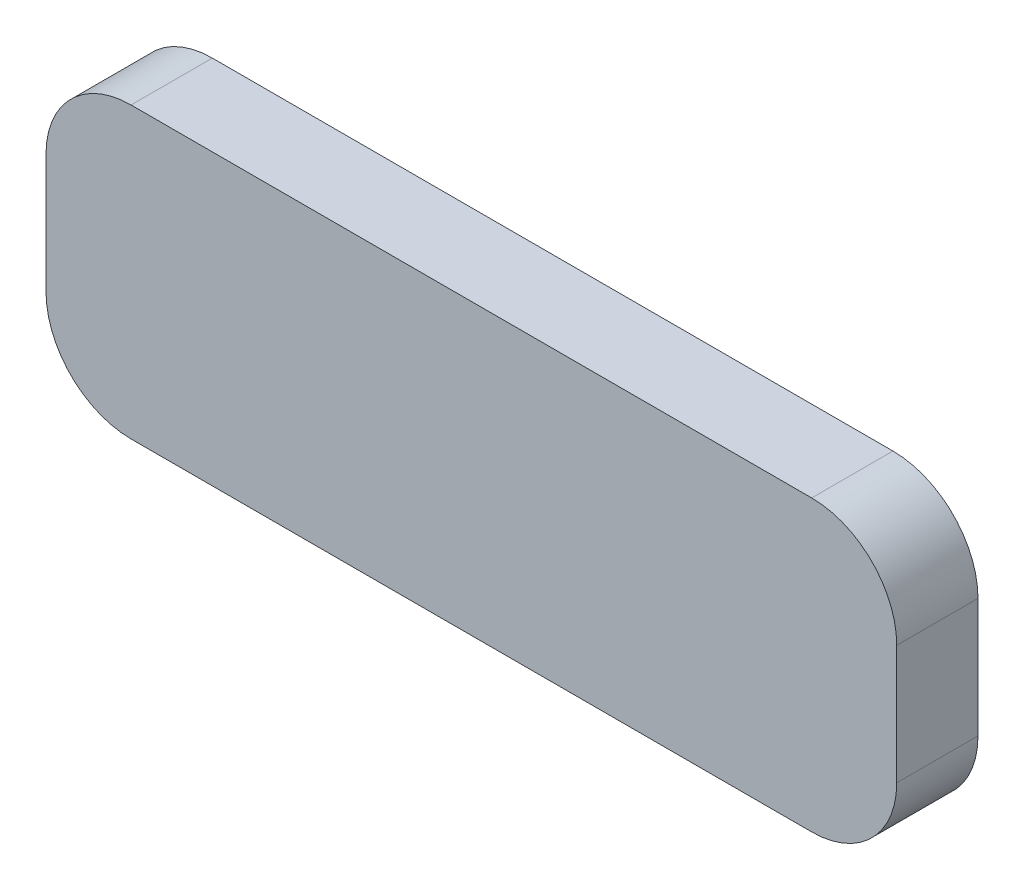
ISO-10303-21;
HEADER;
FILE_DESCRIPTION(('STEP AP214'),'2;1');
FILE_NAME('part.step','',(''),(''),'','','');
FILE_SCHEMA(('AUTOMOTIVE_DESIGN { 1 0 10303 214 1 1 1 1 }'));
ENDSEC;
DATA;
#1=APPLICATION_CONTEXT('core data for automotive mechanical design processes');
#2=APPLICATION_PROTOCOL_DEFINITION('international standard','automotive_design',2000,#1);
#3=PRODUCT_CONTEXT('',#1,'mechanical');
#4=PRODUCT('Part','Part','',(#3));
#5=PRODUCT_RELATED_PRODUCT_CATEGORY('part','',(#4));
#6=PRODUCT_DEFINITION_FORMATION('','',#4);
#7=PRODUCT_DEFINITION_CONTEXT('part definition',#1,'design');
#8=PRODUCT_DEFINITION('design','',#6,#7);
#9=PRODUCT_DEFINITION_SHAPE('','',#8);
#10=(LENGTH_UNIT() NAMED_UNIT(*) SI_UNIT(.MILLI.,.METRE.));
#11=(NAMED_UNIT(*) PLANE_ANGLE_UNIT() SI_UNIT($,.RADIAN.));
#12=(NAMED_UNIT(*) SI_UNIT($,.STERADIAN.) SOLID_ANGLE_UNIT());
#13=UNCERTAINTY_MEASURE_WITH_UNIT(LENGTH_MEASURE(1.E-05),#10,'distance_accuracy_value','');
#14=(GEOMETRIC_REPRESENTATION_CONTEXT(3) GLOBAL_UNCERTAINTY_ASSIGNED_CONTEXT((#13)) GLOBAL_UNIT_ASSIGNED_CONTEXT((#10,
#11,#12)) REPRESENTATION_CONTEXT('',''));
#15=CARTESIAN_POINT('',(0.,0.,0.));
#16=DIRECTION('',(0.,0.,1.));
#17=DIRECTION('',(1.,0.,0.));
#18=AXIS2_PLACEMENT_3D('',#15,#16,#17);
#19=CARTESIAN_POINT('',(5.,0.224799999999999,4.7752));
#20=DIRECTION('',(0.,0.,-1.));
#21=DIRECTION('',(-1.,0.,0.));
#22=AXIS2_PLACEMENT_3D('',#19,#20,#21);
#23=CYLINDRICAL_SURFACE('',#22,5.);
#24=CARTESIAN_POINT('',(5.,0.224799999999999,0.));
#25=DIRECTION('',(0.,0.,1.));
#26=DIRECTION('',(1.,0.,0.));
#27=AXIS2_PLACEMENT_3D('',#24,#25,#26);
#28=CIRCLE('',#27,5.);
#29=CARTESIAN_POINT('',(0.,0.224800000000035,0.));
#30=VERTEX_POINT('',#29);
#31=CARTESIAN_POINT('',(5.00000000000004,-4.7752,0.));
#32=VERTEX_POINT('',#31);
#33=EDGE_CURVE('E148',#30,#32,#28,.T.);
#34=ORIENTED_EDGE('',*,*,#33,.T.);
#35=DIRECTION('',(0.,0.,-1.));
#36=VECTOR('',#35,1.);
#37=CARTESIAN_POINT('',(5.00000000000004,-4.7752,4.7752));
#38=LINE('',#37,#36);
#39=CARTESIAN_POINT('',(5.00000000000004,-4.7752,4.7752));
#40=VERTEX_POINT('',#39);
#41=EDGE_CURVE('E11',#40,#32,#38,.T.);
#42=ORIENTED_EDGE('',*,*,#41,.F.);
#43=CARTESIAN_POINT('',(5.,0.224799999999999,4.7752));
#44=DIRECTION('',(0.,0.,1.));
#45=DIRECTION('',(1.,0.,0.));
#46=AXIS2_PLACEMENT_3D('',#43,#44,#45);
#47=CIRCLE('',#46,5.);
#48=CARTESIAN_POINT('',(0.,0.224800000000035,4.7752));
#49=VERTEX_POINT('',#48);
#50=EDGE_CURVE('E170',#49,#40,#47,.T.);
#51=ORIENTED_EDGE('',*,*,#50,.F.);
#52=DIRECTION('',(0.,0.,-1.));
#53=VECTOR('',#52,1.);
#54=CARTESIAN_POINT('',(0.,0.224800000000035,4.7752));
#55=LINE('',#54,#53);
#56=EDGE_CURVE('E144',#49,#30,#55,.T.);
#57=ORIENTED_EDGE('',*,*,#56,.T.);
#58=EDGE_LOOP('',(#34,#42,#51,#57));
#59=FACE_BOUND('',#58,.T.);
#60=ADVANCED_FACE('F47',(#59),#23,.T.);
#61=CARTESIAN_POINT('',(5.00000000000004,-4.7752,4.7752));
#62=DIRECTION('',(0.,1.,0.));
#63=DIRECTION('',(0.,0.,1.));
#64=AXIS2_PLACEMENT_3D('',#61,#62,#63);
#65=PLANE('',#64);
#66=DIRECTION('',(1.,0.,0.));
#67=VECTOR('',#66,1.);
#68=CARTESIAN_POINT('',(5.00000000000004,-4.7752,0.));
#69=LINE('',#68,#67);
#70=CARTESIAN_POINT('',(45.,-4.7752,0.));
#71=VERTEX_POINT('',#70);
#72=EDGE_CURVE('E152',#32,#71,#69,.T.);
#73=ORIENTED_EDGE('',*,*,#72,.T.);
#74=DIRECTION('',(0.,0.,-1.));
#75=VECTOR('',#74,1.);
#76=CARTESIAN_POINT('',(45.,-4.7752,4.7752));
#77=LINE('',#76,#75);
#78=CARTESIAN_POINT('',(45.,-4.7752,4.7752));
#79=VERTEX_POINT('',#78);
#80=EDGE_CURVE('E56',#79,#71,#77,.T.);
#81=ORIENTED_EDGE('',*,*,#80,.F.);
#82=DIRECTION('',(1.,0.,0.));
#83=VECTOR('',#82,1.);
#84=CARTESIAN_POINT('',(5.00000000000004,-4.7752,4.7752));
#85=LINE('',#84,#83);
#86=EDGE_CURVE('E107',#40,#79,#85,.T.);
#87=ORIENTED_EDGE('',*,*,#86,.F.);
#88=ORIENTED_EDGE('',*,*,#41,.T.);
#89=EDGE_LOOP('',(#73,#81,#87,#88));
#90=FACE_BOUND('',#89,.T.);
#91=ADVANCED_FACE('F216',(#90),#65,.F.);
#92=CARTESIAN_POINT('',(45.,0.224799999999999,4.7752));
#93=DIRECTION('',(0.,0.,-1.));
#94=DIRECTION('',(-1.,0.,0.));
#95=AXIS2_PLACEMENT_3D('',#92,#93,#94);
#96=CYLINDRICAL_SURFACE('',#95,5.);
#97=CARTESIAN_POINT('',(45.,0.224799999999999,0.));
#98=DIRECTION('',(0.,0.,1.));
#99=DIRECTION('',(1.,0.,0.));
#100=AXIS2_PLACEMENT_3D('',#97,#98,#99);
#101=CIRCLE('',#100,5.);
#102=CARTESIAN_POINT('',(50.,0.224800000000035,0.));
#103=VERTEX_POINT('',#102);
#104=EDGE_CURVE('E155',#71,#103,#101,.T.);
#105=ORIENTED_EDGE('',*,*,#104,.T.);
#106=DIRECTION('',(0.,0.,-1.));
#107=VECTOR('',#106,1.);
#108=CARTESIAN_POINT('',(50.,0.224800000000035,4.7752));
#109=LINE('',#108,#107);
#110=CARTESIAN_POINT('',(50.,0.224800000000035,4.7752));
#111=VERTEX_POINT('',#110);
#112=EDGE_CURVE('E181',#111,#103,#109,.T.);
#113=ORIENTED_EDGE('',*,*,#112,.F.);
#114=CARTESIAN_POINT('',(45.,0.224799999999999,4.7752));
#115=DIRECTION('',(0.,0.,1.));
#116=DIRECTION('',(1.,0.,0.));
#117=AXIS2_PLACEMENT_3D('',#114,#115,#116);
#118=CIRCLE('',#117,5.);
#119=EDGE_CURVE('E191',#79,#111,#118,.T.);
#120=ORIENTED_EDGE('',*,*,#119,.F.);
#121=ORIENTED_EDGE('',*,*,#80,.T.);
#122=EDGE_LOOP('',(#105,#113,#120,#121));
#123=FACE_BOUND('',#122,.T.);
#124=ADVANCED_FACE('F189',(#123),#96,.T.);
#125=CARTESIAN_POINT('',(50.,7.2248,4.7752));
#126=DIRECTION('',(-1.,0.,0.));
#127=DIRECTION('',(0.,0.,1.));
#128=AXIS2_PLACEMENT_3D('',#125,#126,#127);
#129=PLANE('',#128);
#130=DIRECTION('',(0.,1.,0.));
#131=VECTOR('',#130,1.);
#132=CARTESIAN_POINT('',(50.,7.2248,0.));
#133=LINE('',#132,#131);
#134=CARTESIAN_POINT('',(50.,7.2248,0.));
#135=VERTEX_POINT('',#134);
#136=EDGE_CURVE('E158',#103,#135,#133,.T.);
#137=ORIENTED_EDGE('',*,*,#136,.T.);
#138=DIRECTION('',(0.,0.,-1.));
#139=VECTOR('',#138,1.);
#140=CARTESIAN_POINT('',(50.,7.2248,4.7752));
#141=LINE('',#140,#139);
#142=CARTESIAN_POINT('',(50.,7.2248,4.7752));
#143=VERTEX_POINT('',#142);
#144=EDGE_CURVE('E177',#143,#135,#141,.T.);
#145=ORIENTED_EDGE('',*,*,#144,.F.);
#146=DIRECTION('',(0.,1.,0.));
#147=VECTOR('',#146,1.);
#148=CARTESIAN_POINT('',(50.,7.2248,4.7752));
#149=LINE('',#148,#147);
#150=EDGE_CURVE('E204',#111,#143,#149,.T.);
#151=ORIENTED_EDGE('',*,*,#150,.F.);
#152=ORIENTED_EDGE('',*,*,#112,.T.);
#153=EDGE_LOOP('',(#137,#145,#151,#152));
#154=FACE_BOUND('',#153,.T.);
#155=ADVANCED_FACE('F199',(#154),#129,.F.);
#156=CARTESIAN_POINT('',(45.,7.2248,4.7752));
#157=DIRECTION('',(0.,0.,-1.));
#158=DIRECTION('',(-1.,0.,0.));
#159=AXIS2_PLACEMENT_3D('',#156,#157,#158);
#160=CYLINDRICAL_SURFACE('',#159,5.);
#161=CARTESIAN_POINT('',(45.,7.2248,0.));
#162=DIRECTION('',(0.,0.,1.));
#163=DIRECTION('',(-1.,0.,0.));
#164=AXIS2_PLACEMENT_3D('',#161,#162,#163);
#165=CIRCLE('',#164,5.);
#166=CARTESIAN_POINT('',(45.,12.2248,0.));
#167=VERTEX_POINT('',#166);
#168=EDGE_CURVE('E161',#135,#167,#165,.T.);
#169=ORIENTED_EDGE('',*,*,#168,.T.);
#170=DIRECTION('',(0.,0.,-1.));
#171=VECTOR('',#170,1.);
#172=CARTESIAN_POINT('',(45.,12.2248,4.7752));
#173=LINE('',#172,#171);
#174=CARTESIAN_POINT('',(45.,12.2248,4.7752));
#175=VERTEX_POINT('',#174);
#176=EDGE_CURVE('E137',#175,#167,#173,.T.);
#177=ORIENTED_EDGE('',*,*,#176,.F.);
#178=CARTESIAN_POINT('',(45.,7.2248,4.7752));
#179=DIRECTION('',(0.,0.,1.));
#180=DIRECTION('',(-1.,0.,0.));
#181=AXIS2_PLACEMENT_3D('',#178,#179,#180);
#182=CIRCLE('',#181,5.);
#183=EDGE_CURVE('E126',#143,#175,#182,.T.);
#184=ORIENTED_EDGE('',*,*,#183,.F.);
#185=ORIENTED_EDGE('',*,*,#144,.T.);
#186=EDGE_LOOP('',(#169,#177,#184,#185));
#187=FACE_BOUND('',#186,.T.);
#188=ADVANCED_FACE('F202',(#187),#160,.T.);
#189=CARTESIAN_POINT('',(5.,12.2248,4.7752));
#190=DIRECTION('',(0.,-1.,0.));
#191=DIRECTION('',(0.,0.,-1.));
#192=AXIS2_PLACEMENT_3D('',#189,#190,#191);
#193=PLANE('',#192);
#194=DIRECTION('',(-1.,0.,0.));
#195=VECTOR('',#194,1.);
#196=CARTESIAN_POINT('',(5.,12.2248,0.));
#197=LINE('',#196,#195);
#198=CARTESIAN_POINT('',(5.,12.2248,0.));
#199=VERTEX_POINT('',#198);
#200=EDGE_CURVE('E135',#167,#199,#197,.T.);
#201=ORIENTED_EDGE('',*,*,#200,.T.);
#202=DIRECTION('',(0.,0.,-1.));
#203=VECTOR('',#202,1.);
#204=CARTESIAN_POINT('',(5.,12.2248,4.7752));
#205=LINE('',#204,#203);
#206=CARTESIAN_POINT('',(5.,12.2248,4.7752));
#207=VERTEX_POINT('',#206);
#208=EDGE_CURVE('E132',#207,#199,#205,.T.);
#209=ORIENTED_EDGE('',*,*,#208,.F.);
#210=DIRECTION('',(-1.,0.,0.));
#211=VECTOR('',#210,1.);
#212=CARTESIAN_POINT('',(5.,12.2248,4.7752));
#213=LINE('',#212,#211);
#214=EDGE_CURVE('E120',#175,#207,#213,.T.);
#215=ORIENTED_EDGE('',*,*,#214,.F.);
#216=ORIENTED_EDGE('',*,*,#176,.T.);
#217=EDGE_LOOP('',(#201,#209,#215,#216));
#218=FACE_BOUND('',#217,.T.);
#219=ADVANCED_FACE('F133',(#218),#193,.F.);
#220=CARTESIAN_POINT('',(5.,7.2248,4.7752));
#221=DIRECTION('',(0.,0.,-1.));
#222=DIRECTION('',(-1.,0.,0.));
#223=AXIS2_PLACEMENT_3D('',#220,#221,#222);
#224=CYLINDRICAL_SURFACE('',#223,5.);
#225=CARTESIAN_POINT('',(5.,7.2248,0.));
#226=DIRECTION('',(0.,0.,1.));
#227=DIRECTION('',(-1.,0.,0.));
#228=AXIS2_PLACEMENT_3D('',#225,#226,#227);
#229=CIRCLE('',#228,5.);
#230=CARTESIAN_POINT('',(0.,7.2248,0.));
#231=VERTEX_POINT('',#230);
#232=EDGE_CURVE('E93',#199,#231,#229,.T.);
#233=ORIENTED_EDGE('',*,*,#232,.T.);
#234=DIRECTION('',(0.,0.,-1.));
#235=VECTOR('',#234,1.);
#236=CARTESIAN_POINT('',(0.,7.2248,4.7752));
#237=LINE('',#236,#235);
#238=CARTESIAN_POINT('',(0.,7.2248,4.7752));
#239=VERTEX_POINT('',#238);
#240=EDGE_CURVE('E138',#239,#231,#237,.T.);
#241=ORIENTED_EDGE('',*,*,#240,.F.);
#242=CARTESIAN_POINT('',(5.,7.2248,4.7752));
#243=DIRECTION('',(0.,0.,1.));
#244=DIRECTION('',(-1.,0.,0.));
#245=AXIS2_PLACEMENT_3D('',#242,#243,#244);
#246=CIRCLE('',#245,5.);
#247=EDGE_CURVE('E124',#207,#239,#246,.T.);
#248=ORIENTED_EDGE('',*,*,#247,.F.);
#249=ORIENTED_EDGE('',*,*,#208,.T.);
#250=EDGE_LOOP('',(#233,#241,#248,#249));
#251=FACE_BOUND('',#250,.T.);
#252=ADVANCED_FACE('F140',(#251),#224,.T.);
#253=CARTESIAN_POINT('',(0.,0.224800000000035,4.7752));
#254=DIRECTION('',(1.,0.,0.));
#255=DIRECTION('',(0.,1.,0.));
#256=AXIS2_PLACEMENT_3D('',#253,#254,#255);
#257=PLANE('',#256);
#258=DIRECTION('',(0.,-1.,0.));
#259=VECTOR('',#258,1.);
#260=CARTESIAN_POINT('',(0.,0.224800000000035,0.));
#261=LINE('',#260,#259);
#262=EDGE_CURVE('E99',#231,#30,#261,.T.);
#263=ORIENTED_EDGE('',*,*,#262,.T.);
#264=ORIENTED_EDGE('',*,*,#56,.F.);
#265=DIRECTION('',(0.,-1.,0.));
#266=VECTOR('',#265,1.);
#267=CARTESIAN_POINT('',(0.,0.224800000000035,4.7752));
#268=LINE('',#267,#266);
#269=EDGE_CURVE('E64',#239,#49,#268,.T.);
#270=ORIENTED_EDGE('',*,*,#269,.F.);
#271=ORIENTED_EDGE('',*,*,#240,.T.);
#272=EDGE_LOOP('',(#263,#264,#270,#271));
#273=FACE_BOUND('',#272,.T.);
#274=ADVANCED_FACE('F232',(#273),#257,.F.);
#275=CARTESIAN_POINT('',(5.,0.224799999999999,4.7752));
#276=DIRECTION('',(0.,0.,1.));
#277=DIRECTION('',(1.,0.,0.));
#278=AXIS2_PLACEMENT_3D('',#275,#276,#277);
#279=PLANE('',#278);
#280=ORIENTED_EDGE('',*,*,#50,.T.);
#281=ORIENTED_EDGE('',*,*,#86,.T.);
#282=ORIENTED_EDGE('',*,*,#119,.T.);
#283=ORIENTED_EDGE('',*,*,#150,.T.);
#284=ORIENTED_EDGE('',*,*,#183,.T.);
#285=ORIENTED_EDGE('',*,*,#214,.T.);
#286=ORIENTED_EDGE('',*,*,#247,.T.);
#287=ORIENTED_EDGE('',*,*,#269,.T.);
#288=EDGE_LOOP('',(#280,#281,#282,#283,#284,#285,#286,#287));
#289=FACE_BOUND('',#288,.T.);
#290=ADVANCED_FACE('F122',(#289),#279,.T.);
#291=CARTESIAN_POINT('',(5.,0.224799999999999,0.));
#292=DIRECTION('',(0.,0.,1.));
#293=DIRECTION('',(1.,0.,0.));
#294=AXIS2_PLACEMENT_3D('',#291,#292,#293);
#295=PLANE('',#294);
#296=ORIENTED_EDGE('',*,*,#33,.F.);
#297=ORIENTED_EDGE('',*,*,#262,.F.);
#298=ORIENTED_EDGE('',*,*,#232,.F.);
#299=ORIENTED_EDGE('',*,*,#200,.F.);
#300=ORIENTED_EDGE('',*,*,#168,.F.);
#301=ORIENTED_EDGE('',*,*,#136,.F.);
#302=ORIENTED_EDGE('',*,*,#104,.F.);
#303=ORIENTED_EDGE('',*,*,#72,.F.);
#304=EDGE_LOOP('',(#296,#297,#298,#299,#300,#301,#302,#303));
#305=FACE_BOUND('',#304,.T.);
#306=ADVANCED_FACE('F195',(#305),#295,.F.);
#307=CLOSED_SHELL('',(#60,#91,#124,#155,#188,#219,#252,#274,#290,#306));
#308=MANIFOLD_SOLID_BREP('B2',#307);
#309=ADVANCED_BREP_SHAPE_REPRESENTATION('',(#18,#308),#14);
#310=SHAPE_DEFINITION_REPRESENTATION(#9,#309);
ENDSEC;
END-ISO-10303-21;
